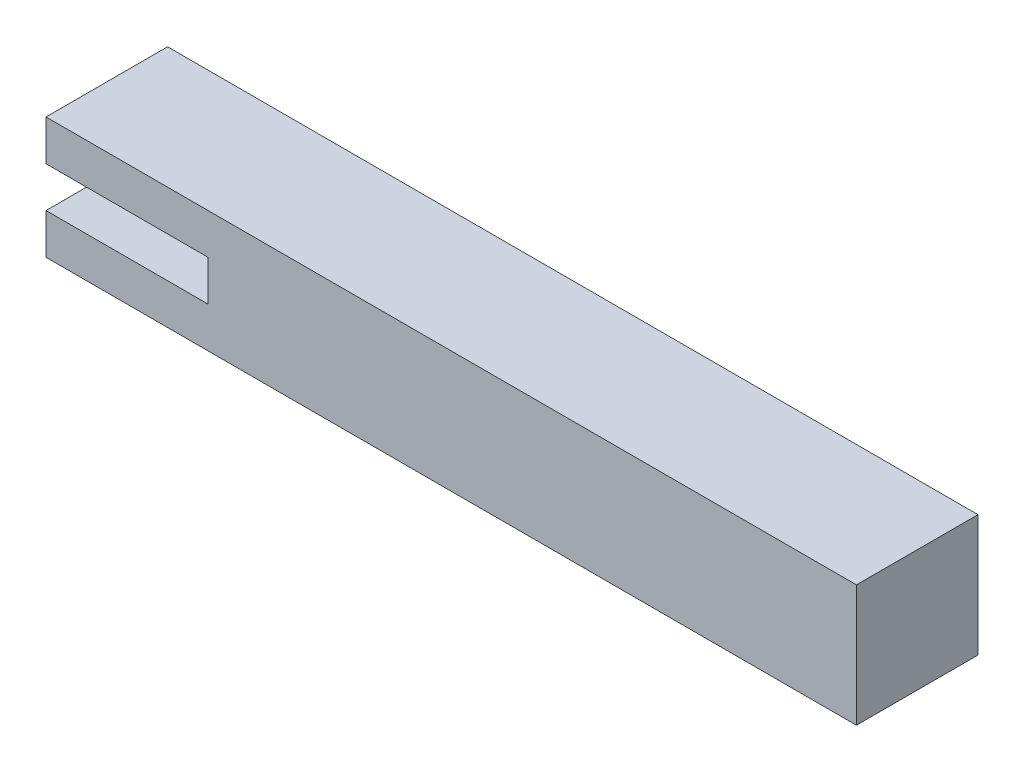
ISO-10303-21;
HEADER;
FILE_DESCRIPTION(('STEP AP214'),'2;1');
FILE_NAME('part.step','',(''),(''),'','','');
FILE_SCHEMA(('AUTOMOTIVE_DESIGN { 1 0 10303 214 1 1 1 1 }'));
ENDSEC;
DATA;
#1=APPLICATION_CONTEXT('core data for automotive mechanical design processes');
#2=APPLICATION_PROTOCOL_DEFINITION('international standard','automotive_design',2000,#1);
#3=PRODUCT_CONTEXT('',#1,'mechanical');
#4=PRODUCT('Part','Part','',(#3));
#5=PRODUCT_RELATED_PRODUCT_CATEGORY('part','',(#4));
#6=PRODUCT_DEFINITION_FORMATION('','',#4);
#7=PRODUCT_DEFINITION_CONTEXT('part definition',#1,'design');
#8=PRODUCT_DEFINITION('design','',#6,#7);
#9=PRODUCT_DEFINITION_SHAPE('','',#8);
#10=(LENGTH_UNIT() NAMED_UNIT(*) SI_UNIT(.MILLI.,.METRE.));
#11=(NAMED_UNIT(*) PLANE_ANGLE_UNIT() SI_UNIT($,.RADIAN.));
#12=(NAMED_UNIT(*) SI_UNIT($,.STERADIAN.) SOLID_ANGLE_UNIT());
#13=UNCERTAINTY_MEASURE_WITH_UNIT(LENGTH_MEASURE(1.E-05),#10,'distance_accuracy_value','');
#14=(GEOMETRIC_REPRESENTATION_CONTEXT(3) GLOBAL_UNCERTAINTY_ASSIGNED_CONTEXT((#13)) GLOBAL_UNIT_ASSIGNED_CONTEXT((#10,
#11,#12)) REPRESENTATION_CONTEXT('',''));
#15=CARTESIAN_POINT('',(0.,0.,0.));
#16=DIRECTION('',(0.,0.,1.));
#17=DIRECTION('',(1.,0.,0.));
#18=AXIS2_PLACEMENT_3D('',#15,#16,#17);
#19=CARTESIAN_POINT('',(200.,0.,0.));
#20=DIRECTION('',(0.,0.,-1.));
#21=DIRECTION('',(-1.,0.,0.));
#22=AXIS2_PLACEMENT_3D('',#19,#20,#21);
#23=PLANE('',#22);
#24=DIRECTION('',(0.,-1.,0.));
#25=VECTOR('',#24,1.);
#26=CARTESIAN_POINT('',(0.,0.,0.));
#27=LINE('',#26,#25);
#28=CARTESIAN_POINT('',(0.,30.,0.));
#29=VERTEX_POINT('',#28);
#30=CARTESIAN_POINT('',(0.,20.,0.));
#31=VERTEX_POINT('',#30);
#32=EDGE_CURVE('E145',#29,#31,#27,.T.);
#33=ORIENTED_EDGE('',*,*,#32,.T.);
#34=DIRECTION('',(-1.,0.,0.));
#35=VECTOR('',#34,1.);
#36=CARTESIAN_POINT('',(0.,20.,0.));
#37=LINE('',#36,#35);
#38=CARTESIAN_POINT('',(40.,20.,0.));
#39=VERTEX_POINT('',#38);
#40=EDGE_CURVE('E126',#39,#31,#37,.T.);
#41=ORIENTED_EDGE('',*,*,#40,.F.);
#42=DIRECTION('',(0.,1.,0.));
#43=VECTOR('',#42,1.);
#44=CARTESIAN_POINT('',(40.,20.,0.));
#45=LINE('',#44,#43);
#46=CARTESIAN_POINT('',(40.,10.,0.));
#47=VERTEX_POINT('',#46);
#48=EDGE_CURVE('E190',#47,#39,#45,.T.);
#49=ORIENTED_EDGE('',*,*,#48,.F.);
#50=DIRECTION('',(1.,0.,0.));
#51=VECTOR('',#50,1.);
#52=CARTESIAN_POINT('',(0.,10.,0.));
#53=LINE('',#52,#51);
#54=CARTESIAN_POINT('',(0.,10.,0.));
#55=VERTEX_POINT('',#54);
#56=EDGE_CURVE('E186',#55,#47,#53,.T.);
#57=ORIENTED_EDGE('',*,*,#56,.F.);
#58=CARTESIAN_POINT('',(0.,0.,0.));
#59=VERTEX_POINT('',#58);
#60=EDGE_CURVE('E131',#55,#59,#27,.T.);
#61=ORIENTED_EDGE('',*,*,#60,.T.);
#62=DIRECTION('',(-1.,0.,0.));
#63=VECTOR('',#62,1.);
#64=CARTESIAN_POINT('',(200.,0.,0.));
#65=LINE('',#64,#63);
#66=CARTESIAN_POINT('',(200.,0.,0.));
#67=VERTEX_POINT('',#66);
#68=EDGE_CURVE('E11',#67,#59,#65,.T.);
#69=ORIENTED_EDGE('',*,*,#68,.F.);
#70=DIRECTION('',(0.,-1.,0.));
#71=VECTOR('',#70,1.);
#72=CARTESIAN_POINT('',(200.,0.,0.));
#73=LINE('',#72,#71);
#74=CARTESIAN_POINT('',(200.,30.,0.));
#75=VERTEX_POINT('',#74);
#76=EDGE_CURVE('E138',#75,#67,#73,.T.);
#77=ORIENTED_EDGE('',*,*,#76,.F.);
#78=DIRECTION('',(-1.,0.,0.));
#79=VECTOR('',#78,1.);
#80=CARTESIAN_POINT('',(200.,30.,0.));
#81=LINE('',#80,#79);
#82=EDGE_CURVE('E144',#75,#29,#81,.T.);
#83=ORIENTED_EDGE('',*,*,#82,.T.);
#84=EDGE_LOOP('',(#33,#41,#49,#57,#61,#69,#77,#83));
#85=FACE_BOUND('',#84,.T.);
#86=ADVANCED_FACE('F37',(#85),#23,.F.);
#87=CARTESIAN_POINT('',(200.,0.,0.));
#88=DIRECTION('',(0.,1.,0.));
#89=DIRECTION('',(0.,0.,1.));
#90=AXIS2_PLACEMENT_3D('',#87,#88,#89);
#91=PLANE('',#90);
#92=DIRECTION('',(0.,0.,-1.));
#93=VECTOR('',#92,1.);
#94=CARTESIAN_POINT('',(0.,0.,0.));
#95=LINE('',#94,#93);
#96=CARTESIAN_POINT('',(0.,0.,-30.));
#97=VERTEX_POINT('',#96);
#98=EDGE_CURVE('E148',#59,#97,#95,.T.);
#99=ORIENTED_EDGE('',*,*,#98,.T.);
#100=DIRECTION('',(-1.,0.,0.));
#101=VECTOR('',#100,1.);
#102=CARTESIAN_POINT('',(200.,0.,-30.));
#103=LINE('',#102,#101);
#104=CARTESIAN_POINT('',(200.,0.,-30.));
#105=VERTEX_POINT('',#104);
#106=EDGE_CURVE('E44',#105,#97,#103,.T.);
#107=ORIENTED_EDGE('',*,*,#106,.F.);
#108=DIRECTION('',(0.,0.,-1.));
#109=VECTOR('',#108,1.);
#110=CARTESIAN_POINT('',(200.,0.,0.));
#111=LINE('',#110,#109);
#112=EDGE_CURVE('E88',#67,#105,#111,.T.);
#113=ORIENTED_EDGE('',*,*,#112,.F.);
#114=ORIENTED_EDGE('',*,*,#68,.T.);
#115=EDGE_LOOP('',(#99,#107,#113,#114));
#116=FACE_BOUND('',#115,.T.);
#117=ADVANCED_FACE('F177',(#116),#91,.F.);
#118=CARTESIAN_POINT('',(200.,0.,-30.));
#119=DIRECTION('',(0.,0.,1.));
#120=DIRECTION('',(1.,0.,0.));
#121=AXIS2_PLACEMENT_3D('',#118,#119,#120);
#122=PLANE('',#121);
#123=DIRECTION('',(0.,1.,0.));
#124=VECTOR('',#123,1.);
#125=CARTESIAN_POINT('',(0.,0.,-30.));
#126=LINE('',#125,#124);
#127=CARTESIAN_POINT('',(0.,30.,-30.));
#128=VERTEX_POINT('',#127);
#129=EDGE_CURVE('E150',#97,#128,#126,.T.);
#130=ORIENTED_EDGE('',*,*,#129,.T.);
#131=DIRECTION('',(-1.,0.,0.));
#132=VECTOR('',#131,1.);
#133=CARTESIAN_POINT('',(200.,30.,-30.));
#134=LINE('',#133,#132);
#135=CARTESIAN_POINT('',(200.,30.,-30.));
#136=VERTEX_POINT('',#135);
#137=EDGE_CURVE('E154',#136,#128,#134,.T.);
#138=ORIENTED_EDGE('',*,*,#137,.F.);
#139=DIRECTION('',(0.,1.,0.));
#140=VECTOR('',#139,1.);
#141=CARTESIAN_POINT('',(200.,0.,-30.));
#142=LINE('',#141,#140);
#143=EDGE_CURVE('E141',#105,#136,#142,.T.);
#144=ORIENTED_EDGE('',*,*,#143,.F.);
#145=ORIENTED_EDGE('',*,*,#106,.T.);
#146=EDGE_LOOP('',(#130,#138,#144,#145));
#147=FACE_BOUND('',#146,.T.);
#148=ADVANCED_FACE('F159',(#147),#122,.F.);
#149=CARTESIAN_POINT('',(200.,30.,0.));
#150=DIRECTION('',(0.,-1.,0.));
#151=DIRECTION('',(0.,0.,-1.));
#152=AXIS2_PLACEMENT_3D('',#149,#150,#151);
#153=PLANE('',#152);
#154=DIRECTION('',(0.,0.,1.));
#155=VECTOR('',#154,1.);
#156=CARTESIAN_POINT('',(0.,30.,0.));
#157=LINE('',#156,#155);
#158=EDGE_CURVE('E81',#128,#29,#157,.T.);
#159=ORIENTED_EDGE('',*,*,#158,.T.);
#160=ORIENTED_EDGE('',*,*,#82,.F.);
#161=DIRECTION('',(0.,0.,1.));
#162=VECTOR('',#161,1.);
#163=CARTESIAN_POINT('',(200.,30.,0.));
#164=LINE('',#163,#162);
#165=EDGE_CURVE('E60',#136,#75,#164,.T.);
#166=ORIENTED_EDGE('',*,*,#165,.F.);
#167=ORIENTED_EDGE('',*,*,#137,.T.);
#168=EDGE_LOOP('',(#159,#160,#166,#167));
#169=FACE_BOUND('',#168,.T.);
#170=ADVANCED_FACE('F168',(#169),#153,.F.);
#171=CARTESIAN_POINT('',(200.,0.,0.));
#172=DIRECTION('',(-1.,0.,0.));
#173=DIRECTION('',(0.,0.,1.));
#174=AXIS2_PLACEMENT_3D('',#171,#172,#173);
#175=PLANE('',#174);
#176=ORIENTED_EDGE('',*,*,#76,.T.);
#177=ORIENTED_EDGE('',*,*,#112,.T.);
#178=ORIENTED_EDGE('',*,*,#143,.T.);
#179=ORIENTED_EDGE('',*,*,#165,.T.);
#180=EDGE_LOOP('',(#176,#177,#178,#179));
#181=FACE_BOUND('',#180,.T.);
#182=ADVANCED_FACE('F170',(#181),#175,.F.);
#183=CARTESIAN_POINT('',(0.,0.,0.));
#184=DIRECTION('',(-1.,0.,0.));
#185=DIRECTION('',(0.,0.,1.));
#186=AXIS2_PLACEMENT_3D('',#183,#184,#185);
#187=PLANE('',#186);
#188=DIRECTION('',(0.,0.,1.));
#189=VECTOR('',#188,1.);
#190=CARTESIAN_POINT('',(0.,20.,-10.));
#191=LINE('',#190,#189);
#192=CARTESIAN_POINT('',(0.,20.,-10.));
#193=VERTEX_POINT('',#192);
#194=EDGE_CURVE('E162',#193,#31,#191,.T.);
#195=ORIENTED_EDGE('',*,*,#194,.T.);
#196=ORIENTED_EDGE('',*,*,#32,.F.);
#197=ORIENTED_EDGE('',*,*,#158,.F.);
#198=ORIENTED_EDGE('',*,*,#129,.F.);
#199=ORIENTED_EDGE('',*,*,#98,.F.);
#200=ORIENTED_EDGE('',*,*,#60,.F.);
#201=DIRECTION('',(0.,0.,1.));
#202=VECTOR('',#201,1.);
#203=CARTESIAN_POINT('',(0.,10.,-10.));
#204=LINE('',#203,#202);
#205=CARTESIAN_POINT('',(0.,10.,-10.));
#206=VERTEX_POINT('',#205);
#207=EDGE_CURVE('E115',#206,#55,#204,.T.);
#208=ORIENTED_EDGE('',*,*,#207,.F.);
#209=DIRECTION('',(0.,-1.,0.));
#210=VECTOR('',#209,1.);
#211=CARTESIAN_POINT('',(0.,10.,-10.));
#212=LINE('',#211,#210);
#213=EDGE_CURVE('E120',#193,#206,#212,.T.);
#214=ORIENTED_EDGE('',*,*,#213,.F.);
#215=EDGE_LOOP('',(#195,#196,#197,#198,#199,#200,#208,#214));
#216=FACE_BOUND('',#215,.T.);
#217=ADVANCED_FACE('F129',(#216),#187,.T.);
#218=CARTESIAN_POINT('',(0.,20.,-10.));
#219=DIRECTION('',(0.,1.,0.));
#220=DIRECTION('',(0.,0.,1.));
#221=AXIS2_PLACEMENT_3D('',#218,#219,#220);
#222=PLANE('',#221);
#223=ORIENTED_EDGE('',*,*,#40,.T.);
#224=ORIENTED_EDGE('',*,*,#194,.F.);
#225=DIRECTION('',(-1.,0.,0.));
#226=VECTOR('',#225,1.);
#227=CARTESIAN_POINT('',(0.,20.,-10.));
#228=LINE('',#227,#226);
#229=CARTESIAN_POINT('',(40.,20.,-10.));
#230=VERTEX_POINT('',#229);
#231=EDGE_CURVE('E51',#230,#193,#228,.T.);
#232=ORIENTED_EDGE('',*,*,#231,.F.);
#233=DIRECTION('',(0.,0.,1.));
#234=VECTOR('',#233,1.);
#235=CARTESIAN_POINT('',(40.,20.,-10.));
#236=LINE('',#235,#234);
#237=EDGE_CURVE('E133',#230,#39,#236,.T.);
#238=ORIENTED_EDGE('',*,*,#237,.T.);
#239=EDGE_LOOP('',(#223,#224,#232,#238));
#240=FACE_BOUND('',#239,.T.);
#241=ADVANCED_FACE('F196',(#240),#222,.F.);
#242=CARTESIAN_POINT('',(40.,20.,-10.));
#243=DIRECTION('',(1.,0.,0.));
#244=DIRECTION('',(0.,0.,-1.));
#245=AXIS2_PLACEMENT_3D('',#242,#243,#244);
#246=PLANE('',#245);
#247=ORIENTED_EDGE('',*,*,#48,.T.);
#248=ORIENTED_EDGE('',*,*,#237,.F.);
#249=DIRECTION('',(0.,1.,0.));
#250=VECTOR('',#249,1.);
#251=CARTESIAN_POINT('',(40.,20.,-10.));
#252=LINE('',#251,#250);
#253=CARTESIAN_POINT('',(40.,10.,-10.));
#254=VERTEX_POINT('',#253);
#255=EDGE_CURVE('E119',#254,#230,#252,.T.);
#256=ORIENTED_EDGE('',*,*,#255,.F.);
#257=DIRECTION('',(0.,0.,1.));
#258=VECTOR('',#257,1.);
#259=CARTESIAN_POINT('',(40.,10.,-10.));
#260=LINE('',#259,#258);
#261=EDGE_CURVE('E117',#254,#47,#260,.T.);
#262=ORIENTED_EDGE('',*,*,#261,.T.);
#263=EDGE_LOOP('',(#247,#248,#256,#262));
#264=FACE_BOUND('',#263,.T.);
#265=ADVANCED_FACE('F197',(#264),#246,.F.);
#266=CARTESIAN_POINT('',(0.,10.,-10.));
#267=DIRECTION('',(0.,-1.,0.));
#268=DIRECTION('',(0.,0.,-1.));
#269=AXIS2_PLACEMENT_3D('',#266,#267,#268);
#270=PLANE('',#269);
#271=ORIENTED_EDGE('',*,*,#56,.T.);
#272=ORIENTED_EDGE('',*,*,#261,.F.);
#273=DIRECTION('',(1.,0.,0.));
#274=VECTOR('',#273,1.);
#275=CARTESIAN_POINT('',(0.,10.,-10.));
#276=LINE('',#275,#274);
#277=EDGE_CURVE('E111',#206,#254,#276,.T.);
#278=ORIENTED_EDGE('',*,*,#277,.F.);
#279=ORIENTED_EDGE('',*,*,#207,.T.);
#280=EDGE_LOOP('',(#271,#272,#278,#279));
#281=FACE_BOUND('',#280,.T.);
#282=ADVANCED_FACE('F113',(#281),#270,.F.);
#283=CARTESIAN_POINT('',(0.,0.,-10.));
#284=DIRECTION('',(0.,0.,-1.));
#285=DIRECTION('',(-1.,0.,0.));
#286=AXIS2_PLACEMENT_3D('',#283,#284,#285);
#287=PLANE('',#286);
#288=ORIENTED_EDGE('',*,*,#213,.T.);
#289=ORIENTED_EDGE('',*,*,#277,.T.);
#290=ORIENTED_EDGE('',*,*,#255,.T.);
#291=ORIENTED_EDGE('',*,*,#231,.T.);
#292=EDGE_LOOP('',(#288,#289,#290,#291));
#293=FACE_BOUND('',#292,.T.);
#294=ADVANCED_FACE('F123',(#293),#287,.F.);
#295=CLOSED_SHELL('',(#86,#117,#148,#170,#182,#217,#241,#265,#282,#294));
#296=MANIFOLD_SOLID_BREP('B2',#295);
#297=ADVANCED_BREP_SHAPE_REPRESENTATION('',(#18,#296),#14);
#298=SHAPE_DEFINITION_REPRESENTATION(#9,#297);
ENDSEC;
END-ISO-10303-21;
